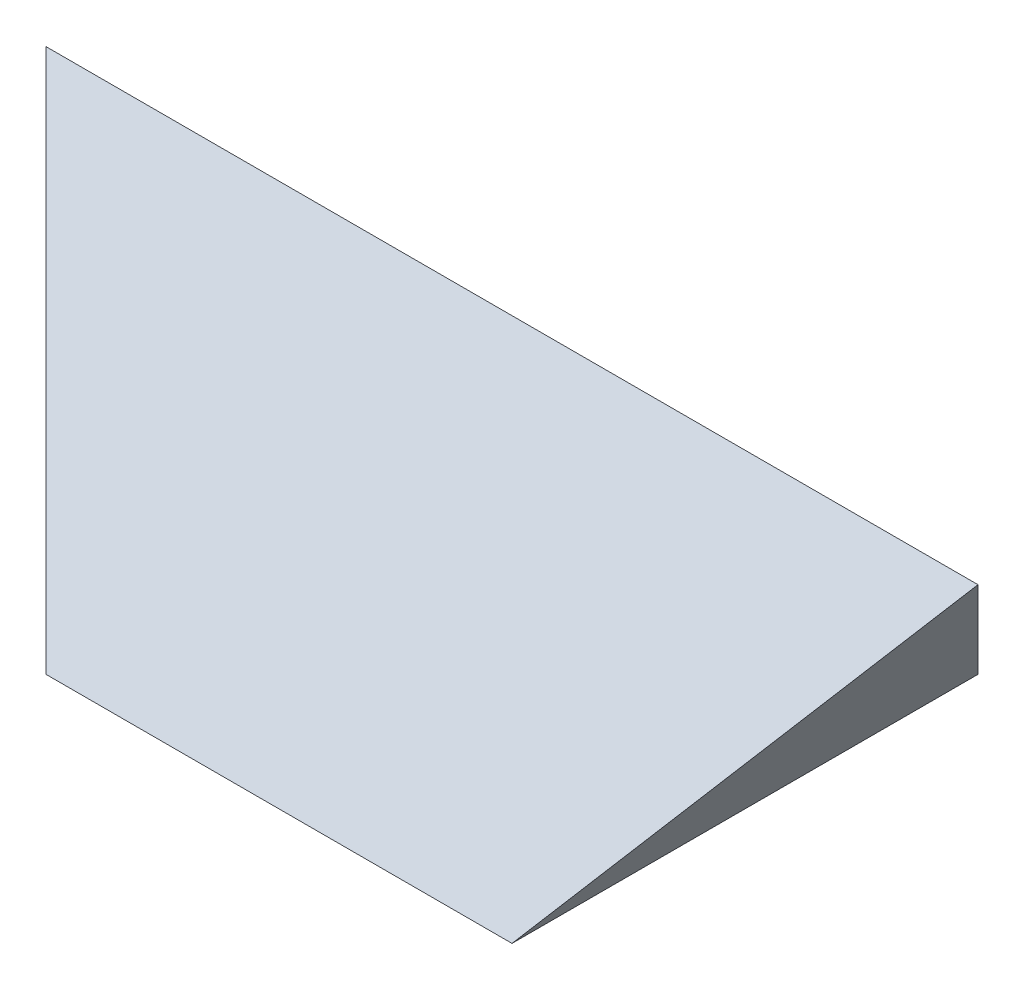
ISO-10303-21;
HEADER;
FILE_DESCRIPTION(('STEP AP214'),'2;1');
FILE_NAME('part.step','',(''),(''),'','','');
FILE_SCHEMA(('AUTOMOTIVE_DESIGN { 1 0 10303 214 1 1 1 1 }'));
ENDSEC;
DATA;
#1=APPLICATION_CONTEXT('core data for automotive mechanical design processes');
#2=APPLICATION_PROTOCOL_DEFINITION('international standard','automotive_design',2000,#1);
#3=PRODUCT_CONTEXT('',#1,'mechanical');
#4=PRODUCT('Part','Part','',(#3));
#5=PRODUCT_RELATED_PRODUCT_CATEGORY('part','',(#4));
#6=PRODUCT_DEFINITION_FORMATION('','',#4);
#7=PRODUCT_DEFINITION_CONTEXT('part definition',#1,'design');
#8=PRODUCT_DEFINITION('design','',#6,#7);
#9=PRODUCT_DEFINITION_SHAPE('','',#8);
#10=(LENGTH_UNIT() NAMED_UNIT(*) SI_UNIT(.MILLI.,.METRE.));
#11=(NAMED_UNIT(*) PLANE_ANGLE_UNIT() SI_UNIT($,.RADIAN.));
#12=(NAMED_UNIT(*) SI_UNIT($,.STERADIAN.) SOLID_ANGLE_UNIT());
#13=UNCERTAINTY_MEASURE_WITH_UNIT(LENGTH_MEASURE(1.E-05),#10,'distance_accuracy_value','');
#14=(GEOMETRIC_REPRESENTATION_CONTEXT(3) GLOBAL_UNCERTAINTY_ASSIGNED_CONTEXT((#13)) GLOBAL_UNIT_ASSIGNED_CONTEXT((#10,
#11,#12)) REPRESENTATION_CONTEXT('',''));
#15=CARTESIAN_POINT('',(0.,0.,0.));
#16=DIRECTION('',(0.,0.,1.));
#17=DIRECTION('',(1.,0.,0.));
#18=AXIS2_PLACEMENT_3D('',#15,#16,#17);
#19=CARTESIAN_POINT('',(-15.,-10.,-22.));
#20=DIRECTION('',(0.8,0.6,0.));
#21=DIRECTION('',(-0.6,0.8,0.));
#22=AXIS2_PLACEMENT_3D('',#19,#20,#21);
#23=PLANE('',#22);
#24=DIRECTION('',(-0.514495755427526,0.685994340570035,0.514495755427527));
#25=VECTOR('',#24,1.);
#26=CARTESIAN_POINT('',(-13.1470588235294,-12.4705882352941,-16.8529411764706));
#27=LINE('',#26,#25);
#28=CARTESIAN_POINT('',(-15.,-10.,-15.));
#29=VERTEX_POINT('',#28);
#30=CARTESIAN_POINT('',(-30.,9.99999999999999,0.));
#31=VERTEX_POINT('',#30);
#32=EDGE_CURVE('E71',#29,#31,#27,.T.);
#33=ORIENTED_EDGE('',*,*,#32,.F.);
#34=DIRECTION('',(0.,0.,1.));
#35=VECTOR('',#34,1.);
#36=CARTESIAN_POINT('',(-15.,-10.,-22.));
#37=LINE('',#36,#35);
#38=CARTESIAN_POINT('',(-15.,-10.,15.));
#39=VERTEX_POINT('',#38);
#40=EDGE_CURVE('E95',#29,#39,#37,.T.);
#41=ORIENTED_EDGE('',*,*,#40,.T.);
#42=DIRECTION('',(0.514495755427526,-0.685994340570036,0.514495755427526));
#43=VECTOR('',#42,1.);
#44=CARTESIAN_POINT('',(-24.7941176470588,3.05882352941176,5.20588235294117));
#45=LINE('',#44,#43);
#46=EDGE_CURVE('E51',#31,#39,#45,.T.);
#47=ORIENTED_EDGE('',*,*,#46,.F.);
#48=EDGE_LOOP('',(#33,#41,#47));
#49=FACE_BOUND('',#48,.T.);
#50=ADVANCED_FACE('F33',(#49),#23,.F.);
#51=CARTESIAN_POINT('',(15.,-10.,-22.));
#52=DIRECTION('',(-0.8,0.6,0.));
#53=DIRECTION('',(-0.6,-0.8,0.));
#54=AXIS2_PLACEMENT_3D('',#51,#52,#53);
#55=PLANE('',#54);
#56=DIRECTION('',(-0.514495755427527,-0.685994340570035,-0.514495755427527));
#57=VECTOR('',#56,1.);
#58=CARTESIAN_POINT('',(13.1470588235294,-12.4705882352941,-16.8529411764706));
#59=LINE('',#58,#57);
#60=CARTESIAN_POINT('',(30.,9.99999999999999,0.));
#61=VERTEX_POINT('',#60);
#62=CARTESIAN_POINT('',(15.,-10.,-15.));
#63=VERTEX_POINT('',#62);
#64=EDGE_CURVE('E68',#61,#63,#59,.T.);
#65=ORIENTED_EDGE('',*,*,#64,.F.);
#66=DIRECTION('',(0.514495755427527,0.685994340570035,-0.514495755427526));
#67=VECTOR('',#66,1.);
#68=CARTESIAN_POINT('',(24.7941176470588,3.05882352941175,5.20588235294118));
#69=LINE('',#68,#67);
#70=CARTESIAN_POINT('',(15.,-10.,15.));
#71=VERTEX_POINT('',#70);
#72=EDGE_CURVE('E11',#71,#61,#69,.T.);
#73=ORIENTED_EDGE('',*,*,#72,.F.);
#74=DIRECTION('',(0.,0.,1.));
#75=VECTOR('',#74,1.);
#76=CARTESIAN_POINT('',(15.,-10.,-22.));
#77=LINE('',#76,#75);
#78=EDGE_CURVE('E76',#63,#71,#77,.T.);
#79=ORIENTED_EDGE('',*,*,#78,.F.);
#80=EDGE_LOOP('',(#65,#73,#79));
#81=FACE_BOUND('',#80,.T.);
#82=ADVANCED_FACE('F74',(#81),#55,.F.);
#83=CARTESIAN_POINT('',(-30.,-10.,15.));
#84=DIRECTION('',(0.,1.,0.));
#85=DIRECTION('',(0.,0.,1.));
#86=AXIS2_PLACEMENT_3D('',#83,#84,#85);
#87=PLANE('',#86);
#88=DIRECTION('',(1.,0.,0.));
#89=VECTOR('',#88,1.);
#90=CARTESIAN_POINT('',(-30.,-10.,-15.));
#91=LINE('',#90,#89);
#92=EDGE_CURVE('E97',#29,#63,#91,.T.);
#93=ORIENTED_EDGE('',*,*,#92,.T.);
#94=ORIENTED_EDGE('',*,*,#78,.T.);
#95=DIRECTION('',(1.,0.,0.));
#96=VECTOR('',#95,1.);
#97=CARTESIAN_POINT('',(-30.,-10.,15.));
#98=LINE('',#97,#96);
#99=EDGE_CURVE('E41',#39,#71,#98,.T.);
#100=ORIENTED_EDGE('',*,*,#99,.F.);
#101=ORIENTED_EDGE('',*,*,#40,.F.);
#102=EDGE_LOOP('',(#93,#94,#100,#101));
#103=FACE_BOUND('',#102,.T.);
#104=ADVANCED_FACE('F35',(#103),#87,.F.);
#105=CARTESIAN_POINT('',(-34.,17.1292937668789,-5.34697032515914));
#106=DIRECTION('',(0.,0.6,0.8));
#107=DIRECTION('',(0.,-0.8,0.6));
#108=AXIS2_PLACEMENT_3D('',#105,#106,#107);
#109=PLANE('',#108);
#110=ORIENTED_EDGE('',*,*,#46,.T.);
#111=ORIENTED_EDGE('',*,*,#99,.T.);
#112=ORIENTED_EDGE('',*,*,#72,.T.);
#113=DIRECTION('',(1.,0.,0.));
#114=VECTOR('',#113,1.);
#115=CARTESIAN_POINT('',(-34.,9.99999999999999,0.));
#116=LINE('',#115,#114);
#117=EDGE_CURVE('E65',#31,#61,#116,.T.);
#118=ORIENTED_EDGE('',*,*,#117,.F.);
#119=EDGE_LOOP('',(#110,#111,#112,#118));
#120=FACE_BOUND('',#119,.T.);
#121=ADVANCED_FACE('F79',(#120),#109,.T.);
#122=CARTESIAN_POINT('',(-34.,-9.92929376687886,-14.9469703251591));
#123=DIRECTION('',(0.,0.6,-0.8));
#124=DIRECTION('',(0.,0.8,0.6));
#125=AXIS2_PLACEMENT_3D('',#122,#123,#124);
#126=PLANE('',#125);
#127=ORIENTED_EDGE('',*,*,#32,.T.);
#128=ORIENTED_EDGE('',*,*,#117,.T.);
#129=ORIENTED_EDGE('',*,*,#64,.T.);
#130=ORIENTED_EDGE('',*,*,#92,.F.);
#131=EDGE_LOOP('',(#127,#128,#129,#130));
#132=FACE_BOUND('',#131,.T.);
#133=ADVANCED_FACE('F67',(#132),#126,.T.);
#134=CLOSED_SHELL('',(#50,#82,#104,#121,#133));
#135=MANIFOLD_SOLID_BREP('B2',#134);
#136=ADVANCED_BREP_SHAPE_REPRESENTATION('',(#18,#135),#14);
#137=SHAPE_DEFINITION_REPRESENTATION(#9,#136);
ENDSEC;
END-ISO-10303-21;
